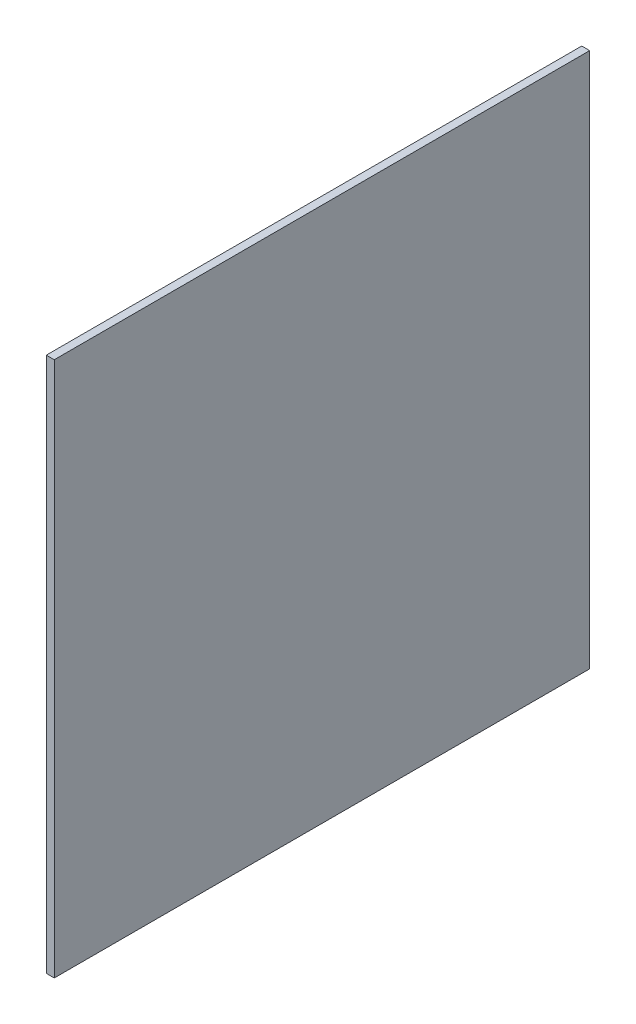
ISO-10303-21;
HEADER;
FILE_DESCRIPTION(('STEP AP214'),'2;1');
FILE_NAME('part.step','',(''),(''),'','','');
FILE_SCHEMA(('AUTOMOTIVE_DESIGN { 1 0 10303 214 1 1 1 1 }'));
ENDSEC;
DATA;
#1=APPLICATION_CONTEXT('core data for automotive mechanical design processes');
#2=APPLICATION_PROTOCOL_DEFINITION('international standard','automotive_design',2000,#1);
#3=PRODUCT_CONTEXT('',#1,'mechanical');
#4=PRODUCT('Part','Part','',(#3));
#5=PRODUCT_RELATED_PRODUCT_CATEGORY('part','',(#4));
#6=PRODUCT_DEFINITION_FORMATION('','',#4);
#7=PRODUCT_DEFINITION_CONTEXT('part definition',#1,'design');
#8=PRODUCT_DEFINITION('design','',#6,#7);
#9=PRODUCT_DEFINITION_SHAPE('','',#8);
#10=(LENGTH_UNIT() NAMED_UNIT(*) SI_UNIT(.MILLI.,.METRE.));
#11=(NAMED_UNIT(*) PLANE_ANGLE_UNIT() SI_UNIT($,.RADIAN.));
#12=(NAMED_UNIT(*) SI_UNIT($,.STERADIAN.) SOLID_ANGLE_UNIT());
#13=UNCERTAINTY_MEASURE_WITH_UNIT(LENGTH_MEASURE(1.E-05),#10,'distance_accuracy_value','');
#14=(GEOMETRIC_REPRESENTATION_CONTEXT(3) GLOBAL_UNCERTAINTY_ASSIGNED_CONTEXT((#13)) GLOBAL_UNIT_ASSIGNED_CONTEXT((#10,
#11,#12)) REPRESENTATION_CONTEXT('',''));
#15=CARTESIAN_POINT('',(0.,0.,0.));
#16=DIRECTION('',(0.,0.,1.));
#17=DIRECTION('',(1.,0.,0.));
#18=AXIS2_PLACEMENT_3D('',#15,#16,#17);
#19=CARTESIAN_POINT('',(97.7536514238677,-49.3069822605414,251.670639251381));
#20=DIRECTION('',(0.,0.,-1.));
#21=DIRECTION('',(-1.,0.,0.));
#22=AXIS2_PLACEMENT_3D('',#19,#20,#21);
#23=PLANE('',#22);
#24=DIRECTION('',(0.,1.,0.));
#25=VECTOR('',#24,1.);
#26=CARTESIAN_POINT('',(99.1897920855022,-49.3069822605414,251.670639251381));
#27=LINE('',#26,#25);
#28=CARTESIAN_POINT('',(99.1897920855022,-49.3069822605414,251.670639251381));
#29=VERTEX_POINT('',#28);
#30=CARTESIAN_POINT('',(99.1897920855022,47.35173923672,251.670639251381));
#31=VERTEX_POINT('',#30);
#32=EDGE_CURVE('E80',#29,#31,#27,.T.);
#33=ORIENTED_EDGE('',*,*,#32,.F.);
#34=DIRECTION('',(1.,0.,0.));
#35=VECTOR('',#34,1.);
#36=CARTESIAN_POINT('',(97.7536514238677,-49.3069822605414,251.670639251381));
#37=LINE('',#36,#35);
#38=CARTESIAN_POINT('',(97.7536514238677,-49.3069822605414,251.670639251381));
#39=VERTEX_POINT('',#38);
#40=EDGE_CURVE('E33',#39,#29,#37,.T.);
#41=ORIENTED_EDGE('',*,*,#40,.F.);
#42=DIRECTION('',(0.,1.,0.));
#43=VECTOR('',#42,1.);
#44=CARTESIAN_POINT('',(97.7536514238677,-49.3069822605414,251.670639251381));
#45=LINE('',#44,#43);
#46=CARTESIAN_POINT('',(97.7536514238677,47.35173923672,251.670639251381));
#47=VERTEX_POINT('',#46);
#48=EDGE_CURVE('E72',#39,#47,#45,.T.);
#49=ORIENTED_EDGE('',*,*,#48,.T.);
#50=DIRECTION('',(1.,0.,0.));
#51=VECTOR('',#50,1.);
#52=CARTESIAN_POINT('',(97.7536514238677,47.35173923672,251.670639251381));
#53=LINE('',#52,#51);
#54=EDGE_CURVE('E11',#47,#31,#53,.T.);
#55=ORIENTED_EDGE('',*,*,#54,.T.);
#56=EDGE_LOOP('',(#33,#41,#49,#55));
#57=FACE_BOUND('',#56,.T.);
#58=ADVANCED_FACE('F17',(#57),#23,.T.);
#59=CARTESIAN_POINT('',(97.7536514238677,47.35173923672,251.670639251381));
#60=DIRECTION('',(0.,1.,0.));
#61=DIRECTION('',(0.,0.,1.));
#62=AXIS2_PLACEMENT_3D('',#59,#60,#61);
#63=PLANE('',#62);
#64=DIRECTION('',(0.,0.,1.));
#65=VECTOR('',#64,1.);
#66=CARTESIAN_POINT('',(99.1897920855022,47.35173923672,251.670639251381));
#67=LINE('',#66,#65);
#68=CARTESIAN_POINT('',(99.1897920855022,47.35173923672,348.329360748642));
#69=VERTEX_POINT('',#68);
#70=EDGE_CURVE('E83',#31,#69,#67,.T.);
#71=ORIENTED_EDGE('',*,*,#70,.F.);
#72=ORIENTED_EDGE('',*,*,#54,.F.);
#73=DIRECTION('',(0.,0.,1.));
#74=VECTOR('',#73,1.);
#75=CARTESIAN_POINT('',(97.7536514238677,47.35173923672,251.670639251381));
#76=LINE('',#75,#74);
#77=CARTESIAN_POINT('',(97.7536514238677,47.35173923672,348.329360748642));
#78=VERTEX_POINT('',#77);
#79=EDGE_CURVE('E68',#47,#78,#76,.T.);
#80=ORIENTED_EDGE('',*,*,#79,.T.);
#81=DIRECTION('',(1.,0.,0.));
#82=VECTOR('',#81,1.);
#83=CARTESIAN_POINT('',(97.7536514238677,47.35173923672,348.329360748642));
#84=LINE('',#83,#82);
#85=EDGE_CURVE('E25',#78,#69,#84,.T.);
#86=ORIENTED_EDGE('',*,*,#85,.T.);
#87=EDGE_LOOP('',(#71,#72,#80,#86));
#88=FACE_BOUND('',#87,.T.);
#89=ADVANCED_FACE('F69',(#88),#63,.T.);
#90=CARTESIAN_POINT('',(97.7536514238677,47.35173923672,348.329360748642));
#91=DIRECTION('',(0.,0.,1.));
#92=DIRECTION('',(1.,0.,0.));
#93=AXIS2_PLACEMENT_3D('',#90,#91,#92);
#94=PLANE('',#93);
#95=DIRECTION('',(0.,-1.,0.));
#96=VECTOR('',#95,1.);
#97=CARTESIAN_POINT('',(99.1897920855022,47.35173923672,348.329360748642));
#98=LINE('',#97,#96);
#99=CARTESIAN_POINT('',(99.1897920855022,-49.3069822605414,348.329360748642));
#100=VERTEX_POINT('',#99);
#101=EDGE_CURVE('E66',#69,#100,#98,.T.);
#102=ORIENTED_EDGE('',*,*,#101,.F.);
#103=ORIENTED_EDGE('',*,*,#85,.F.);
#104=DIRECTION('',(0.,-1.,0.));
#105=VECTOR('',#104,1.);
#106=CARTESIAN_POINT('',(97.7536514238677,47.35173923672,348.329360748642));
#107=LINE('',#106,#105);
#108=CARTESIAN_POINT('',(97.7536514238677,-49.3069822605414,348.329360748642));
#109=VERTEX_POINT('',#108);
#110=EDGE_CURVE('E63',#78,#109,#107,.T.);
#111=ORIENTED_EDGE('',*,*,#110,.T.);
#112=DIRECTION('',(1.,0.,0.));
#113=VECTOR('',#112,1.);
#114=CARTESIAN_POINT('',(97.7536514238677,-49.3069822605414,348.329360748642));
#115=LINE('',#114,#113);
#116=EDGE_CURVE('E49',#109,#100,#115,.T.);
#117=ORIENTED_EDGE('',*,*,#116,.T.);
#118=EDGE_LOOP('',(#102,#103,#111,#117));
#119=FACE_BOUND('',#118,.T.);
#120=ADVANCED_FACE('F61',(#119),#94,.T.);
#121=CARTESIAN_POINT('',(97.7536514238677,-49.3069822605414,348.329360748642));
#122=DIRECTION('',(0.,-1.,0.));
#123=DIRECTION('',(0.,0.,-1.));
#124=AXIS2_PLACEMENT_3D('',#121,#122,#123);
#125=PLANE('',#124);
#126=DIRECTION('',(0.,0.,-1.));
#127=VECTOR('',#126,1.);
#128=CARTESIAN_POINT('',(99.1897920855022,-49.3069822605414,348.329360748642));
#129=LINE('',#128,#127);
#130=EDGE_CURVE('E86',#100,#29,#129,.T.);
#131=ORIENTED_EDGE('',*,*,#130,.F.);
#132=ORIENTED_EDGE('',*,*,#116,.F.);
#133=DIRECTION('',(0.,0.,-1.));
#134=VECTOR('',#133,1.);
#135=CARTESIAN_POINT('',(97.7536514238677,-49.3069822605414,348.329360748642));
#136=LINE('',#135,#134);
#137=EDGE_CURVE('E75',#109,#39,#136,.T.);
#138=ORIENTED_EDGE('',*,*,#137,.T.);
#139=ORIENTED_EDGE('',*,*,#40,.T.);
#140=EDGE_LOOP('',(#131,#132,#138,#139));
#141=FACE_BOUND('',#140,.T.);
#142=ADVANCED_FACE('F98',(#141),#125,.T.);
#143=CARTESIAN_POINT('',(97.7536514238677,-0.977621511910692,253.000000000011));
#144=DIRECTION('',(1.,0.,0.));
#145=DIRECTION('',(0.,1.,0.));
#146=AXIS2_PLACEMENT_3D('',#143,#144,#145);
#147=PLANE('',#146);
#148=ORIENTED_EDGE('',*,*,#48,.F.);
#149=ORIENTED_EDGE('',*,*,#137,.F.);
#150=ORIENTED_EDGE('',*,*,#110,.F.);
#151=ORIENTED_EDGE('',*,*,#79,.F.);
#152=EDGE_LOOP('',(#148,#149,#150,#151));
#153=FACE_BOUND('',#152,.T.);
#154=ADVANCED_FACE('F74',(#153),#147,.F.);
#155=CARTESIAN_POINT('',(99.1897920855022,-0.977621511910692,253.000000000011));
#156=DIRECTION('',(1.,0.,0.));
#157=DIRECTION('',(0.,1.,0.));
#158=AXIS2_PLACEMENT_3D('',#155,#156,#157);
#159=PLANE('',#158);
#160=ORIENTED_EDGE('',*,*,#32,.T.);
#161=ORIENTED_EDGE('',*,*,#70,.T.);
#162=ORIENTED_EDGE('',*,*,#101,.T.);
#163=ORIENTED_EDGE('',*,*,#130,.T.);
#164=EDGE_LOOP('',(#160,#161,#162,#163));
#165=FACE_BOUND('',#164,.T.);
#166=ADVANCED_FACE('F90',(#165),#159,.T.);
#167=CLOSED_SHELL('',(#58,#89,#120,#142,#154,#166));
#168=MANIFOLD_SOLID_BREP('B1',#167);
#169=ADVANCED_BREP_SHAPE_REPRESENTATION('',(#18,#168),#14);
#170=SHAPE_DEFINITION_REPRESENTATION(#9,#169);
ENDSEC;
END-ISO-10303-21;
